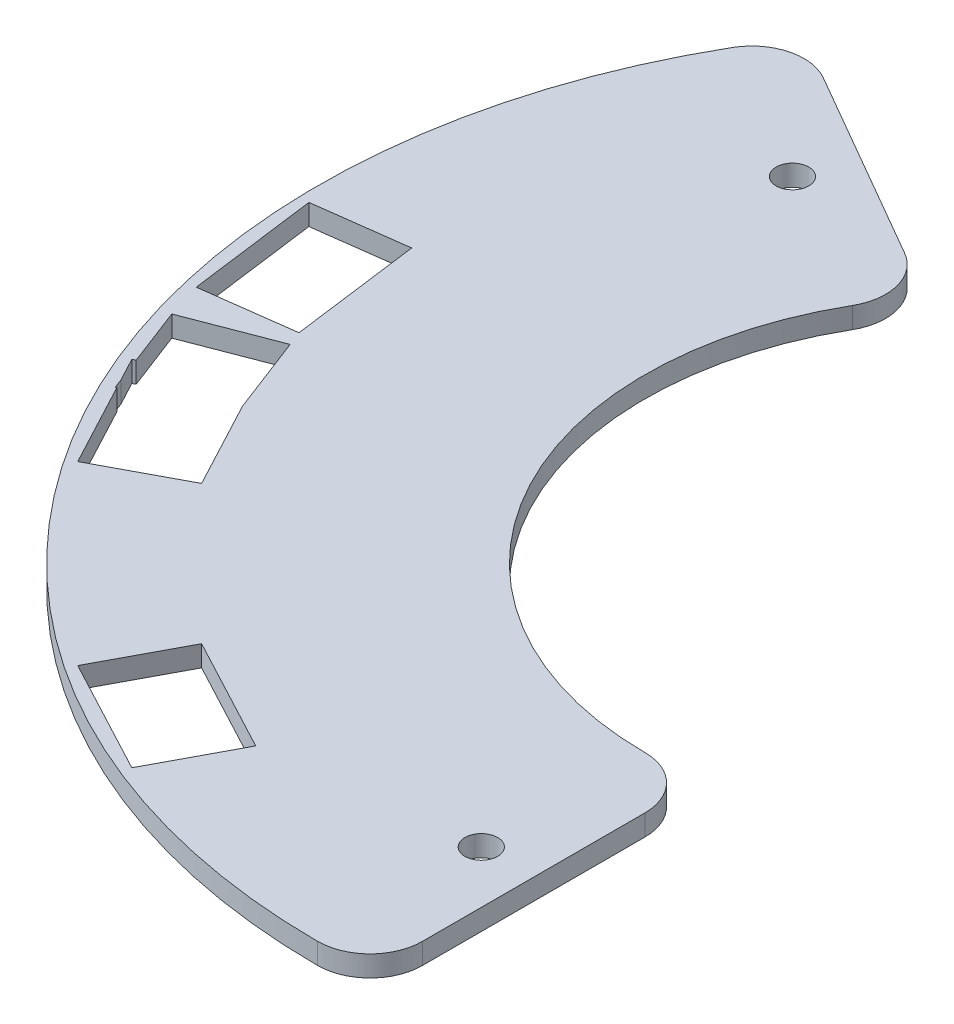
ISO-10303-21;
HEADER;
FILE_DESCRIPTION(('STEP AP214'),'2;1');
FILE_NAME('part.step','',(''),(''),'','','');
FILE_SCHEMA(('AUTOMOTIVE_DESIGN { 1 0 10303 214 1 1 1 1 }'));
ENDSEC;
DATA;
#1=APPLICATION_CONTEXT('core data for automotive mechanical design processes');
#2=APPLICATION_PROTOCOL_DEFINITION('international standard','automotive_design',2000,#1);
#3=PRODUCT_CONTEXT('',#1,'mechanical');
#4=PRODUCT('Part','Part','',(#3));
#5=PRODUCT_RELATED_PRODUCT_CATEGORY('part','',(#4));
#6=PRODUCT_DEFINITION_FORMATION('','',#4);
#7=PRODUCT_DEFINITION_CONTEXT('part definition',#1,'design');
#8=PRODUCT_DEFINITION('design','',#6,#7);
#9=PRODUCT_DEFINITION_SHAPE('','',#8);
#10=(LENGTH_UNIT() NAMED_UNIT(*) SI_UNIT(.MILLI.,.METRE.));
#11=(NAMED_UNIT(*) PLANE_ANGLE_UNIT() SI_UNIT($,.RADIAN.));
#12=(NAMED_UNIT(*) SI_UNIT($,.STERADIAN.) SOLID_ANGLE_UNIT());
#13=UNCERTAINTY_MEASURE_WITH_UNIT(LENGTH_MEASURE(1.E-05),#10,'distance_accuracy_value','');
#14=(GEOMETRIC_REPRESENTATION_CONTEXT(3) GLOBAL_UNCERTAINTY_ASSIGNED_CONTEXT((#13)) GLOBAL_UNIT_ASSIGNED_CONTEXT((#10,
#11,#12)) REPRESENTATION_CONTEXT('',''));
#15=CARTESIAN_POINT('',(0.,0.,0.));
#16=DIRECTION('',(0.,0.,1.));
#17=DIRECTION('',(1.,0.,0.));
#18=AXIS2_PLACEMENT_3D('',#15,#16,#17);
#19=CARTESIAN_POINT('',(0.,0.8,0.));
#20=DIRECTION('',(0.,1.,0.));
#21=DIRECTION('',(0.,0.,1.));
#22=AXIS2_PLACEMENT_3D('',#19,#20,#21);
#23=PLANE('',#22);
#24=DIRECTION('',(-0.991444861373811,0.,0.130526192220048));
#25=VECTOR('',#24,1.);
#26=CARTESIAN_POINT('',(-42.2933151388003,0.8,0.524875766372985));
#27=LINE('',#26,#25);
#28=CARTESIAN_POINT('',(-42.2933151388003,0.8,0.524875766372985));
#29=VERTEX_POINT('',#28);
#30=CARTESIAN_POINT('',(-49.233429168417,0.8,1.43855911191332));
#31=VERTEX_POINT('',#30);
#32=EDGE_CURVE('E288',#29,#31,#27,.T.);
#33=ORIENTED_EDGE('',*,*,#32,.F.);
#34=DIRECTION('',(0.130526192220048,0.,0.991444861373811));
#35=VECTOR('',#34,1.);
#36=CARTESIAN_POINT('',(-42.2933151388003,0.8,0.524875766372985));
#37=LINE('',#36,#35);
#38=CARTESIAN_POINT('',(-40.9880532165998,0.8,10.4393243801111));
#39=VERTEX_POINT('',#38);
#40=EDGE_CURVE('E292',#29,#39,#37,.T.);
#41=ORIENTED_EDGE('',*,*,#40,.T.);
#42=DIRECTION('',(-0.991444861373811,0.,0.130526192220048));
#43=VECTOR('',#42,1.);
#44=CARTESIAN_POINT('',(-40.9880532165998,0.8,10.4393243801111));
#45=LINE('',#44,#43);
#46=CARTESIAN_POINT('',(-47.9281672462165,0.8,11.3530077256514));
#47=VERTEX_POINT('',#46);
#48=EDGE_CURVE('E270',#39,#47,#45,.T.);
#49=ORIENTED_EDGE('',*,*,#48,.T.);
#50=DIRECTION('',(0.130526192220048,0.,0.991444861373811));
#51=VECTOR('',#50,1.);
#52=CARTESIAN_POINT('',(-49.233429168417,0.8,1.43855911191332));
#53=LINE('',#52,#51);
#54=EDGE_CURVE('E283',#31,#47,#53,.T.);
#55=ORIENTED_EDGE('',*,*,#54,.F.);
#56=EDGE_LOOP('',(#33,#41,#49,#55));
#57=FACE_BOUND('',#56,.T.);
#58=DIRECTION('',(-0.46947156278589,0.,0.882947592858927));
#59=VECTOR('',#58,1.);
#60=CARTESIAN_POINT('',(-24.1325436013021,0.8,34.7364410861455));
#61=LINE('',#60,#59);
#62=CARTESIAN_POINT('',(-24.1325436013021,0.8,34.7364410861455));
#63=VERTEX_POINT('',#62);
#64=CARTESIAN_POINT('',(-27.4188445408033,0.8,40.9170742361579));
#65=VERTEX_POINT('',#64);
#66=EDGE_CURVE('E360',#63,#65,#61,.T.);
#67=ORIENTED_EDGE('',*,*,#66,.F.);
#68=DIRECTION('',(0.882947592858928,0.,0.46947156278589));
#69=VECTOR('',#68,1.);
#70=CARTESIAN_POINT('',(-24.1325436013021,0.8,34.7364410861455));
#71=LINE('',#70,#69);
#72=CARTESIAN_POINT('',(-15.3030676727128,0.8,39.4311567140044));
#73=VERTEX_POINT('',#72);
#74=EDGE_CURVE('E348',#63,#73,#71,.T.);
#75=ORIENTED_EDGE('',*,*,#74,.T.);
#76=DIRECTION('',(-0.46947156278589,0.,0.882947592858927));
#77=VECTOR('',#76,1.);
#78=CARTESIAN_POINT('',(-15.3030676727128,0.8,39.4311567140044));
#79=LINE('',#78,#77);
#80=CARTESIAN_POINT('',(-18.589368612214,0.8,45.6117898640168));
#81=VERTEX_POINT('',#80);
#82=EDGE_CURVE('E352',#73,#81,#79,.T.);
#83=ORIENTED_EDGE('',*,*,#82,.T.);
#84=DIRECTION('',(0.882947592858927,0.,0.469471562785891));
#85=VECTOR('',#84,1.);
#86=CARTESIAN_POINT('',(-27.4188445408033,0.8,40.9170742361579));
#87=LINE('',#86,#85);
#88=EDGE_CURVE('E356',#65,#81,#87,.T.);
#89=ORIENTED_EDGE('',*,*,#88,.F.);
#90=EDGE_LOOP('',(#67,#75,#83,#89));
#91=FACE_BOUND('',#90,.T.);
#92=DIRECTION('',(-0.933580426497203,0.,0.358367949545297));
#93=VECTOR('',#92,1.);
#94=CARTESIAN_POINT('',(-40.5542577236774,0.8,11.550527281538));
#95=LINE('',#94,#93);
#96=CARTESIAN_POINT('',(-40.5542577236774,0.8,11.550527281538));
#97=VERTEX_POINT('',#96);
#98=CARTESIAN_POINT('',(-47.0893207091578,0.8,14.0591029283551));
#99=VERTEX_POINT('',#98);
#100=EDGE_CURVE('E388',#97,#99,#95,.T.);
#101=ORIENTED_EDGE('',*,*,#100,.F.);
#102=DIRECTION('',(0.358367949545297,0.,0.933580426497203));
#103=VECTOR('',#102,1.);
#104=CARTESIAN_POINT('',(-40.5542577236774,0.8,11.550527281538));
#105=LINE('',#104,#103);
#106=CARTESIAN_POINT('',(-38.2897915564523,0.8,17.4496633311451));
#107=VERTEX_POINT('',#106);
#108=EDGE_CURVE('E443',#97,#107,#105,.T.);
#109=ORIENTED_EDGE('',*,*,#108,.T.);
#110=DIRECTION('',(0.469471562785888,0.,0.882947592858928));
#111=VECTOR('',#110,1.);
#112=CARTESIAN_POINT('',(-39.4311567140044,0.8,15.3030676727127));
#113=LINE('',#112,#111);
#114=CARTESIAN_POINT('',(-34.7364410861455,0.8,24.132543601302));
#115=VERTEX_POINT('',#114);
#116=EDGE_CURVE('E403',#107,#115,#113,.T.);
#117=ORIENTED_EDGE('',*,*,#116,.T.);
#118=DIRECTION('',(-0.882947592858928,0.,0.469471562785888));
#119=VECTOR('',#118,1.);
#120=CARTESIAN_POINT('',(-34.7364410861455,0.8,24.132543601302));
#121=LINE('',#120,#119);
#122=CARTESIAN_POINT('',(-40.917074236158,0.8,27.4188445408032));
#123=VERTEX_POINT('',#122);
#124=EDGE_CURVE('E407',#115,#123,#121,.T.);
#125=ORIENTED_EDGE('',*,*,#124,.T.);
#126=DIRECTION('',(0.469471562785888,0.,0.882947592858928));
#127=VECTOR('',#126,1.);
#128=CARTESIAN_POINT('',(-45.6117898640169,0.8,18.5893686122139));
#129=LINE('',#128,#127);
#130=CARTESIAN_POINT('',(-44.3152416289966,0.8,21.0278211914148));
#131=VERTEX_POINT('',#130);
#132=EDGE_CURVE('E415',#131,#123,#129,.T.);
#133=ORIENTED_EDGE('',*,*,#132,.F.);
#134=DIRECTION('',(-0.933580426497203,0.,0.358367949545298));
#135=VECTOR('',#134,1.);
#136=CARTESIAN_POINT('',(-37.8664981020876,0.8,18.552380480267));
#137=LINE('',#136,#135);
#138=CARTESIAN_POINT('',(-44.401561087568,0.8,21.0609561270841));
#139=VERTEX_POINT('',#138);
#140=EDGE_CURVE('E447',#131,#139,#137,.T.);
#141=ORIENTED_EDGE('',*,*,#140,.T.);
#142=DIRECTION('',(0.358367949545297,0.,0.933580426497203));
#143=VECTOR('',#142,1.);
#144=CARTESIAN_POINT('',(-47.0893207091578,0.8,14.0591029283551));
#145=LINE('',#144,#143);
#146=CARTESIAN_POINT('',(-44.6714234825277,0.8,20.3579405530028));
#147=VERTEX_POINT('',#146);
#148=EDGE_CURVE('E454',#147,#139,#145,.T.);
#149=ORIENTED_EDGE('',*,*,#148,.F.);
#150=CARTESIAN_POINT('',(-45.6117898640169,0.8,18.5893686122139));
#151=VERTEX_POINT('',#150);
#152=EDGE_CURVE('E411',#151,#147,#129,.T.);
#153=ORIENTED_EDGE('',*,*,#152,.F.);
#154=DIRECTION('',(-0.882947592858928,0.,0.469471562785888));
#155=VECTOR('',#154,1.);
#156=CARTESIAN_POINT('',(-39.4311567140044,0.8,15.3030676727127));
#157=LINE('',#156,#155);
#158=CARTESIAN_POINT('',(-45.394636534842,0.8,18.4739061389749));
#159=VERTEX_POINT('',#158);
#160=EDGE_CURVE('E333',#159,#151,#157,.T.);
#161=ORIENTED_EDGE('',*,*,#160,.F.);
#162=EDGE_CURVE('E451',#99,#159,#145,.T.);
#163=ORIENTED_EDGE('',*,*,#162,.F.);
#164=EDGE_LOOP('',(#101,#109,#117,#125,#133,#141,#149,#153,#161,#163));
#165=FACE_BOUND('',#164,.T.);
#166=CARTESIAN_POINT('',(-32.4759526419164,0.8,-18.7500000000001));
#167=DIRECTION('',(0.,1.,0.));
#168=DIRECTION('',(0.,0.,1.));
#169=AXIS2_PLACEMENT_3D('',#166,#167,#168);
#170=CIRCLE('',#169,1.25);
#171=CARTESIAN_POINT('',(-32.4759526419164,0.8,-17.5000000000001));
#172=VERTEX_POINT('',#171);
#173=EDGE_CURVE('E466',#172,#172,#170,.T.);
#174=ORIENTED_EDGE('',*,*,#173,.F.);
#175=EDGE_LOOP('',(#174));
#176=FACE_BOUND('',#175,.T.);
#177=CARTESIAN_POINT('',(0.,0.8,0.));
#178=DIRECTION('',(0.,1.,0.));
#179=DIRECTION('',(0.,0.,1.));
#180=AXIS2_PLACEMENT_3D('',#177,#178,#179);
#181=CIRCLE('',#180,50.);
#182=CARTESIAN_POINT('',(-43.3012701892218,0.8,-25.0000000000002));
#183=VERTEX_POINT('',#182);
#184=CARTESIAN_POINT('',(0.,0.8,50.));
#185=VERTEX_POINT('',#184);
#186=EDGE_CURVE('E474',#183,#185,#181,.T.);
#187=ORIENTED_EDGE('',*,*,#186,.T.);
#188=CARTESIAN_POINT('',(0.,0.8,46.));
#189=DIRECTION('',(0.,1.,0.));
#190=DIRECTION('',(0.,0.,1.));
#191=AXIS2_PLACEMENT_3D('',#188,#189,#190);
#192=CIRCLE('',#191,4.);
#193=CARTESIAN_POINT('',(4.,0.8,46.));
#194=VERTEX_POINT('',#193);
#195=EDGE_CURVE('E536',#185,#194,#192,.T.);
#196=ORIENTED_EDGE('',*,*,#195,.T.);
#197=DIRECTION('',(0.,0.,-1.));
#198=VECTOR('',#197,1.);
#199=CARTESIAN_POINT('',(4.,0.8,24.6779253585061));
#200=LINE('',#199,#198);
#201=CARTESIAN_POINT('',(4.,0.8,29.));
#202=VERTEX_POINT('',#201);
#203=EDGE_CURVE('E478',#194,#202,#200,.T.);
#204=ORIENTED_EDGE('',*,*,#203,.T.);
#205=CARTESIAN_POINT('',(0.,0.8,29.));
#206=DIRECTION('',(0.,1.,0.));
#207=DIRECTION('',(0.,0.,1.));
#208=AXIS2_PLACEMENT_3D('',#205,#206,#207);
#209=CIRCLE('',#208,4.);
#210=CARTESIAN_POINT('',(0.,0.8,25.));
#211=VERTEX_POINT('',#210);
#212=EDGE_CURVE('E528',#202,#211,#209,.T.);
#213=ORIENTED_EDGE('',*,*,#212,.T.);
#214=CARTESIAN_POINT('',(0.,0.8,0.));
#215=DIRECTION('',(0.,-1.,0.));
#216=DIRECTION('',(0.,0.,1.));
#217=AXIS2_PLACEMENT_3D('',#214,#215,#216);
#218=CIRCLE('',#217,25.);
#219=CARTESIAN_POINT('',(-21.6506350946109,0.8,-12.5000000000001));
#220=VERTEX_POINT('',#219);
#221=EDGE_CURVE('E483',#211,#220,#218,.T.);
#222=ORIENTED_EDGE('',*,*,#221,.T.);
#223=CARTESIAN_POINT('',(-25.1147367097487,0.8,-14.5000000000001));
#224=DIRECTION('',(0.,1.,0.));
#225=DIRECTION('',(0.,0.,1.));
#226=AXIS2_PLACEMENT_3D('',#223,#224,#225);
#227=CIRCLE('',#226,4.);
#228=CARTESIAN_POINT('',(-23.1147367097486,0.8,-17.9641016151379));
#229=VERTEX_POINT('',#228);
#230=EDGE_CURVE('E113',#220,#229,#227,.T.);
#231=ORIENTED_EDGE('',*,*,#230,.T.);
#232=DIRECTION('',(-0.866025403784436,0.,-0.500000000000004));
#233=VECTOR('',#232,1.);
#234=CARTESIAN_POINT('',(-41.1624837098143,0.8,-28.3839732038922));
#235=LINE('',#234,#233);
#236=CARTESIAN_POINT('',(-37.8371685740841,0.8,-26.4641016151379));
#237=VERTEX_POINT('',#236);
#238=EDGE_CURVE('E486',#229,#237,#235,.T.);
#239=ORIENTED_EDGE('',*,*,#238,.T.);
#240=CARTESIAN_POINT('',(-39.8371685740841,0.8,-23.0000000000002));
#241=DIRECTION('',(0.,1.,0.));
#242=DIRECTION('',(0.,0.,1.));
#243=AXIS2_PLACEMENT_3D('',#240,#241,#242);
#244=CIRCLE('',#243,4.);
#245=EDGE_CURVE('E533',#237,#183,#244,.T.);
#246=ORIENTED_EDGE('',*,*,#245,.T.);
#247=EDGE_LOOP('',(#187,#196,#204,#213,#222,#231,#239,#246));
#248=FACE_BOUND('',#247,.T.);
#249=CARTESIAN_POINT('',(0.,0.8,37.5));
#250=DIRECTION('',(0.,1.,0.));
#251=DIRECTION('',(0.,0.,1.));
#252=AXIS2_PLACEMENT_3D('',#249,#250,#251);
#253=CIRCLE('',#252,1.25);
#254=CARTESIAN_POINT('',(0.,0.8,38.75));
#255=VERTEX_POINT('',#254);
#256=EDGE_CURVE('E458',#255,#255,#253,.T.);
#257=ORIENTED_EDGE('',*,*,#256,.F.);
#258=EDGE_LOOP('',(#257));
#259=FACE_BOUND('',#258,.T.);
#260=ADVANCED_FACE('F90',(#57,#91,#165,#176,#248,#259),#23,.T.);
#261=CARTESIAN_POINT('',(0.,-0.8,0.));
#262=DIRECTION('',(0.,1.,0.));
#263=DIRECTION('',(0.,0.,1.));
#264=AXIS2_PLACEMENT_3D('',#261,#262,#263);
#265=PLANE('',#264);
#266=DIRECTION('',(0.130526192220048,0.,0.991444861373811));
#267=VECTOR('',#266,1.);
#268=CARTESIAN_POINT('',(-42.2933151388003,-0.8,0.524875766372985));
#269=LINE('',#268,#267);
#270=CARTESIAN_POINT('',(-42.2933151388003,-0.8,0.524875766372985));
#271=VERTEX_POINT('',#270);
#272=CARTESIAN_POINT('',(-40.9880532165998,-0.8,10.4393243801111));
#273=VERTEX_POINT('',#272);
#274=EDGE_CURVE('E308',#271,#273,#269,.T.);
#275=ORIENTED_EDGE('',*,*,#274,.F.);
#276=DIRECTION('',(-0.991444861373811,0.,0.130526192220048));
#277=VECTOR('',#276,1.);
#278=CARTESIAN_POINT('',(-42.2933151388003,-0.8,0.524875766372985));
#279=LINE('',#278,#277);
#280=CARTESIAN_POINT('',(-49.233429168417,-0.8,1.43855911191332));
#281=VERTEX_POINT('',#280);
#282=EDGE_CURVE('E296',#271,#281,#279,.T.);
#283=ORIENTED_EDGE('',*,*,#282,.T.);
#284=DIRECTION('',(0.130526192220048,0.,0.991444861373811));
#285=VECTOR('',#284,1.);
#286=CARTESIAN_POINT('',(-49.233429168417,-0.8,1.43855911191332));
#287=LINE('',#286,#285);
#288=CARTESIAN_POINT('',(-47.9281672462165,-0.8,11.3530077256514));
#289=VERTEX_POINT('',#288);
#290=EDGE_CURVE('E303',#281,#289,#287,.T.);
#291=ORIENTED_EDGE('',*,*,#290,.T.);
#292=DIRECTION('',(-0.991444861373811,0.,0.130526192220048));
#293=VECTOR('',#292,1.);
#294=CARTESIAN_POINT('',(-40.9880532165998,-0.8,10.4393243801111));
#295=LINE('',#294,#293);
#296=EDGE_CURVE('E273',#273,#289,#295,.T.);
#297=ORIENTED_EDGE('',*,*,#296,.F.);
#298=EDGE_LOOP('',(#275,#283,#291,#297));
#299=FACE_BOUND('',#298,.T.);
#300=DIRECTION('',(0.882947592858928,0.,0.46947156278589));
#301=VECTOR('',#300,1.);
#302=CARTESIAN_POINT('',(-24.1325436013021,-0.8,34.7364410861455));
#303=LINE('',#302,#301);
#304=CARTESIAN_POINT('',(-24.1325436013021,-0.8,34.7364410861455));
#305=VERTEX_POINT('',#304);
#306=CARTESIAN_POINT('',(-15.3030676727128,-0.8,39.4311567140044));
#307=VERTEX_POINT('',#306);
#308=EDGE_CURVE('E323',#305,#307,#303,.T.);
#309=ORIENTED_EDGE('',*,*,#308,.F.);
#310=DIRECTION('',(-0.46947156278589,0.,0.882947592858927));
#311=VECTOR('',#310,1.);
#312=CARTESIAN_POINT('',(-24.1325436013021,-0.8,34.7364410861455));
#313=LINE('',#312,#311);
#314=CARTESIAN_POINT('',(-27.4188445408033,-0.8,40.9170742361579));
#315=VERTEX_POINT('',#314);
#316=EDGE_CURVE('E344',#305,#315,#313,.T.);
#317=ORIENTED_EDGE('',*,*,#316,.T.);
#318=DIRECTION('',(0.882947592858927,0.,0.469471562785891));
#319=VECTOR('',#318,1.);
#320=CARTESIAN_POINT('',(-27.4188445408033,-0.8,40.9170742361579));
#321=LINE('',#320,#319);
#322=CARTESIAN_POINT('',(-18.589368612214,-0.8,45.6117898640168));
#323=VERTEX_POINT('',#322);
#324=EDGE_CURVE('E340',#315,#323,#321,.T.);
#325=ORIENTED_EDGE('',*,*,#324,.T.);
#326=DIRECTION('',(-0.46947156278589,0.,0.882947592858927));
#327=VECTOR('',#326,1.);
#328=CARTESIAN_POINT('',(-15.3030676727128,-0.8,39.4311567140044));
#329=LINE('',#328,#327);
#330=EDGE_CURVE('E336',#307,#323,#329,.T.);
#331=ORIENTED_EDGE('',*,*,#330,.F.);
#332=EDGE_LOOP('',(#309,#317,#325,#331));
#333=FACE_BOUND('',#332,.T.);
#334=DIRECTION('',(0.358367949545297,0.,0.933580426497203));
#335=VECTOR('',#334,1.);
#336=CARTESIAN_POINT('',(-40.5542577236774,-0.8,11.550527281538));
#337=LINE('',#336,#335);
#338=CARTESIAN_POINT('',(-40.5542577236774,-0.8,11.550527281538));
#339=VERTEX_POINT('',#338);
#340=CARTESIAN_POINT('',(-38.2897915564523,-0.8,17.4496633311451));
#341=VERTEX_POINT('',#340);
#342=EDGE_CURVE('E421',#339,#341,#337,.T.);
#343=ORIENTED_EDGE('',*,*,#342,.F.);
#344=DIRECTION('',(-0.933580426497203,0.,0.358367949545297));
#345=VECTOR('',#344,1.);
#346=CARTESIAN_POINT('',(-40.5542577236774,-0.8,11.550527281538));
#347=LINE('',#346,#345);
#348=CARTESIAN_POINT('',(-47.0893207091578,-0.8,14.0591029283551));
#349=VERTEX_POINT('',#348);
#350=EDGE_CURVE('E439',#339,#349,#347,.T.);
#351=ORIENTED_EDGE('',*,*,#350,.T.);
#352=DIRECTION('',(0.358367949545297,0.,0.933580426497203));
#353=VECTOR('',#352,1.);
#354=CARTESIAN_POINT('',(-47.0893207091578,-0.8,14.0591029283551));
#355=LINE('',#354,#353);
#356=CARTESIAN_POINT('',(-45.394636534842,-0.8,18.4739061389749));
#357=VERTEX_POINT('',#356);
#358=EDGE_CURVE('E434',#349,#357,#355,.T.);
#359=ORIENTED_EDGE('',*,*,#358,.T.);
#360=DIRECTION('',(-0.882947592858928,0.,0.469471562785888));
#361=VECTOR('',#360,1.);
#362=CARTESIAN_POINT('',(-39.4311567140044,-0.8,15.3030676727127));
#363=LINE('',#362,#361);
#364=CARTESIAN_POINT('',(-45.6117898640169,-0.8,18.5893686122139));
#365=VERTEX_POINT('',#364);
#366=EDGE_CURVE('E399',#357,#365,#363,.T.);
#367=ORIENTED_EDGE('',*,*,#366,.T.);
#368=DIRECTION('',(0.469471562785888,0.,0.882947592858928));
#369=VECTOR('',#368,1.);
#370=CARTESIAN_POINT('',(-45.6117898640169,-0.8,18.5893686122139));
#371=LINE('',#370,#369);
#372=CARTESIAN_POINT('',(-44.6714234825277,-0.8,20.3579405530028));
#373=VERTEX_POINT('',#372);
#374=EDGE_CURVE('E394',#365,#373,#371,.T.);
#375=ORIENTED_EDGE('',*,*,#374,.T.);
#376=CARTESIAN_POINT('',(-44.401561087568,-0.8,21.0609561270841));
#377=VERTEX_POINT('',#376);
#378=EDGE_CURVE('E438',#373,#377,#355,.T.);
#379=ORIENTED_EDGE('',*,*,#378,.T.);
#380=DIRECTION('',(-0.933580426497203,0.,0.358367949545298));
#381=VECTOR('',#380,1.);
#382=CARTESIAN_POINT('',(-37.8664981020876,-0.8,18.552380480267));
#383=LINE('',#382,#381);
#384=CARTESIAN_POINT('',(-44.3152416289966,-0.8,21.0278211914148));
#385=VERTEX_POINT('',#384);
#386=EDGE_CURVE('E431',#385,#377,#383,.T.);
#387=ORIENTED_EDGE('',*,*,#386,.F.);
#388=CARTESIAN_POINT('',(-40.917074236158,-0.8,27.4188445408032));
#389=VERTEX_POINT('',#388);
#390=EDGE_CURVE('E398',#385,#389,#371,.T.);
#391=ORIENTED_EDGE('',*,*,#390,.T.);
#392=DIRECTION('',(-0.882947592858928,0.,0.469471562785888));
#393=VECTOR('',#392,1.);
#394=CARTESIAN_POINT('',(-34.7364410861455,-0.8,24.132543601302));
#395=LINE('',#394,#393);
#396=CARTESIAN_POINT('',(-34.7364410861455,-0.8,24.132543601302));
#397=VERTEX_POINT('',#396);
#398=EDGE_CURVE('E391',#397,#389,#395,.T.);
#399=ORIENTED_EDGE('',*,*,#398,.F.);
#400=DIRECTION('',(0.469471562785888,0.,0.882947592858928));
#401=VECTOR('',#400,1.);
#402=CARTESIAN_POINT('',(-39.4311567140044,-0.8,15.3030676727127));
#403=LINE('',#402,#401);
#404=EDGE_CURVE('E380',#341,#397,#403,.T.);
#405=ORIENTED_EDGE('',*,*,#404,.F.);
#406=EDGE_LOOP('',(#343,#351,#359,#367,#375,#379,#387,#391,#399,#405));
#407=FACE_BOUND('',#406,.T.);
#408=DIRECTION('',(0.,0.,-1.));
#409=VECTOR('',#408,1.);
#410=CARTESIAN_POINT('',(4.,-0.8,24.6779253585061));
#411=LINE('',#410,#409);
#412=CARTESIAN_POINT('',(4.,-0.8,46.));
#413=VERTEX_POINT('',#412);
#414=CARTESIAN_POINT('',(4.,-0.8,29.));
#415=VERTEX_POINT('',#414);
#416=EDGE_CURVE('E493',#413,#415,#411,.T.);
#417=ORIENTED_EDGE('',*,*,#416,.F.);
#418=CARTESIAN_POINT('',(0.,-0.8,46.));
#419=DIRECTION('',(0.,1.,0.));
#420=DIRECTION('',(0.,0.,1.));
#421=AXIS2_PLACEMENT_3D('',#418,#419,#420);
#422=CIRCLE('',#421,4.);
#423=CARTESIAN_POINT('',(0.,-0.8,50.));
#424=VERTEX_POINT('',#423);
#425=EDGE_CURVE('E518',#413,#424,#422,.F.);
#426=ORIENTED_EDGE('',*,*,#425,.T.);
#427=CARTESIAN_POINT('',(0.,-0.8,0.));
#428=DIRECTION('',(0.,1.,0.));
#429=DIRECTION('',(0.,0.,1.));
#430=AXIS2_PLACEMENT_3D('',#427,#428,#429);
#431=CIRCLE('',#430,50.);
#432=CARTESIAN_POINT('',(-43.3012701892218,-0.8,-25.0000000000002));
#433=VERTEX_POINT('',#432);
#434=EDGE_CURVE('E470',#433,#424,#431,.T.);
#435=ORIENTED_EDGE('',*,*,#434,.F.);
#436=CARTESIAN_POINT('',(-39.8371685740841,-0.8,-23.0000000000002));
#437=DIRECTION('',(0.,1.,0.));
#438=DIRECTION('',(0.,0.,1.));
#439=AXIS2_PLACEMENT_3D('',#436,#437,#438);
#440=CIRCLE('',#439,4.);
#441=CARTESIAN_POINT('',(-37.8371685740841,-0.8,-26.4641016151379));
#442=VERTEX_POINT('',#441);
#443=EDGE_CURVE('E515',#433,#442,#440,.F.);
#444=ORIENTED_EDGE('',*,*,#443,.T.);
#445=DIRECTION('',(-0.866025403784436,0.,-0.500000000000004));
#446=VECTOR('',#445,1.);
#447=CARTESIAN_POINT('',(-41.1624837098143,-0.8,-28.3839732038922));
#448=LINE('',#447,#446);
#449=CARTESIAN_POINT('',(-23.1147367097486,-0.8,-17.9641016151379));
#450=VERTEX_POINT('',#449);
#451=EDGE_CURVE('E479',#450,#442,#448,.T.);
#452=ORIENTED_EDGE('',*,*,#451,.F.);
#453=CARTESIAN_POINT('',(-25.1147367097487,-0.8,-14.5000000000001));
#454=DIRECTION('',(0.,1.,0.));
#455=DIRECTION('',(0.,0.,1.));
#456=AXIS2_PLACEMENT_3D('',#453,#454,#455);
#457=CIRCLE('',#456,4.);
#458=CARTESIAN_POINT('',(-21.6506350946109,-0.8,-12.5000000000001));
#459=VERTEX_POINT('',#458);
#460=EDGE_CURVE('E512',#450,#459,#457,.F.);
#461=ORIENTED_EDGE('',*,*,#460,.T.);
#462=CARTESIAN_POINT('',(0.,-0.8,0.));
#463=DIRECTION('',(0.,-1.,0.));
#464=DIRECTION('',(0.,0.,1.));
#465=AXIS2_PLACEMENT_3D('',#462,#463,#464);
#466=CIRCLE('',#465,25.);
#467=CARTESIAN_POINT('',(0.,-0.8,25.));
#468=VERTEX_POINT('',#467);
#469=EDGE_CURVE('E497',#468,#459,#466,.T.);
#470=ORIENTED_EDGE('',*,*,#469,.F.);
#471=CARTESIAN_POINT('',(0.,-0.8,29.));
#472=DIRECTION('',(0.,1.,0.));
#473=DIRECTION('',(0.,0.,1.));
#474=AXIS2_PLACEMENT_3D('',#471,#472,#473);
#475=CIRCLE('',#474,4.);
#476=EDGE_CURVE('E509',#468,#415,#475,.F.);
#477=ORIENTED_EDGE('',*,*,#476,.T.);
#478=EDGE_LOOP('',(#417,#426,#435,#444,#452,#461,#470,#477));
#479=FACE_BOUND('',#478,.T.);
#480=CARTESIAN_POINT('',(-32.4759526419164,-0.8,-18.7500000000001));
#481=DIRECTION('',(0.,1.,0.));
#482=DIRECTION('',(0.,0.,1.));
#483=AXIS2_PLACEMENT_3D('',#480,#481,#482);
#484=CIRCLE('',#483,1.25);
#485=CARTESIAN_POINT('',(-32.4759526419164,-0.8,-17.5000000000001));
#486=VERTEX_POINT('',#485);
#487=EDGE_CURVE('E462',#486,#486,#484,.T.);
#488=ORIENTED_EDGE('',*,*,#487,.T.);
#489=EDGE_LOOP('',(#488));
#490=FACE_BOUND('',#489,.T.);
#491=CARTESIAN_POINT('',(0.,-0.8,37.5));
#492=DIRECTION('',(0.,1.,0.));
#493=DIRECTION('',(0.,0.,1.));
#494=AXIS2_PLACEMENT_3D('',#491,#492,#493);
#495=CIRCLE('',#494,1.25);
#496=CARTESIAN_POINT('',(0.,-0.8,38.75));
#497=VERTEX_POINT('',#496);
#498=EDGE_CURVE('E314',#497,#497,#495,.T.);
#499=ORIENTED_EDGE('',*,*,#498,.T.);
#500=EDGE_LOOP('',(#499));
#501=FACE_BOUND('',#500,.T.);
#502=ADVANCED_FACE('F556',(#299,#333,#407,#479,#490,#501),#265,.F.);
#503=CARTESIAN_POINT('',(0.,0.8,0.));
#504=DIRECTION('',(0.,-1.,0.));
#505=DIRECTION('',(0.,0.,-1.));
#506=AXIS2_PLACEMENT_3D('',#503,#504,#505);
#507=CYLINDRICAL_SURFACE('',#506,50.);
#508=ORIENTED_EDGE('',*,*,#434,.T.);
#509=DIRECTION('',(0.,-1.,0.));
#510=VECTOR('',#509,1.);
#511=CARTESIAN_POINT('',(0.,0.8,50.));
#512=LINE('',#511,#510);
#513=EDGE_CURVE('E525',#424,#185,#512,.F.);
#514=ORIENTED_EDGE('',*,*,#513,.T.);
#515=ORIENTED_EDGE('',*,*,#186,.F.);
#516=DIRECTION('',(0.,-1.,0.));
#517=VECTOR('',#516,1.);
#518=CARTESIAN_POINT('',(-43.3012701892218,0.8,-25.0000000000002));
#519=LINE('',#518,#517);
#520=EDGE_CURVE('E521',#183,#433,#519,.T.);
#521=ORIENTED_EDGE('',*,*,#520,.T.);
#522=EDGE_LOOP('',(#508,#514,#515,#521));
#523=FACE_BOUND('',#522,.T.);
#524=ADVANCED_FACE('F571',(#523),#507,.T.);
#525=CARTESIAN_POINT('',(4.,0.8,24.6779253585061));
#526=DIRECTION('',(-1.,0.,0.));
#527=DIRECTION('',(0.,0.,1.));
#528=AXIS2_PLACEMENT_3D('',#525,#526,#527);
#529=PLANE('',#528);
#530=ORIENTED_EDGE('',*,*,#203,.F.);
#531=DIRECTION('',(0.,-1.,0.));
#532=VECTOR('',#531,1.);
#533=CARTESIAN_POINT('',(4.,0.8,46.));
#534=LINE('',#533,#532);
#535=EDGE_CURVE('E505',#194,#413,#534,.T.);
#536=ORIENTED_EDGE('',*,*,#535,.T.);
#537=ORIENTED_EDGE('',*,*,#416,.T.);
#538=DIRECTION('',(0.,-1.,0.));
#539=VECTOR('',#538,1.);
#540=CARTESIAN_POINT('',(4.,0.8,29.));
#541=LINE('',#540,#539);
#542=EDGE_CURVE('E489',#415,#202,#541,.F.);
#543=ORIENTED_EDGE('',*,*,#542,.T.);
#544=EDGE_LOOP('',(#530,#536,#537,#543));
#545=FACE_BOUND('',#544,.T.);
#546=ADVANCED_FACE('F579',(#545),#529,.F.);
#547=CARTESIAN_POINT('',(0.,0.8,0.));
#548=DIRECTION('',(0.,-1.,0.));
#549=DIRECTION('',(0.,0.,-1.));
#550=AXIS2_PLACEMENT_3D('',#547,#548,#549);
#551=CYLINDRICAL_SURFACE('',#550,25.);
#552=ORIENTED_EDGE('',*,*,#469,.T.);
#553=DIRECTION('',(0.,-1.,0.));
#554=VECTOR('',#553,1.);
#555=CARTESIAN_POINT('',(-21.6506350946109,0.8,-12.5000000000001));
#556=LINE('',#555,#554);
#557=EDGE_CURVE('E12',#459,#220,#556,.F.);
#558=ORIENTED_EDGE('',*,*,#557,.T.);
#559=ORIENTED_EDGE('',*,*,#221,.F.);
#560=DIRECTION('',(0.,-1.,0.));
#561=VECTOR('',#560,1.);
#562=CARTESIAN_POINT('',(0.,0.8,25.));
#563=LINE('',#562,#561);
#564=EDGE_CURVE('E99',#211,#468,#563,.T.);
#565=ORIENTED_EDGE('',*,*,#564,.T.);
#566=EDGE_LOOP('',(#552,#558,#559,#565));
#567=FACE_BOUND('',#566,.T.);
#568=ADVANCED_FACE('F550',(#567),#551,.F.);
#569=CARTESIAN_POINT('',(-41.1624837098143,0.8,-28.3839732038922));
#570=DIRECTION('',(-0.500000000000004,0.,0.866025403784436));
#571=DIRECTION('',(0.866025403784436,0.,0.500000000000004));
#572=AXIS2_PLACEMENT_3D('',#569,#570,#571);
#573=PLANE('',#572);
#574=ORIENTED_EDGE('',*,*,#451,.T.);
#575=DIRECTION('',(0.,-1.,0.));
#576=VECTOR('',#575,1.);
#577=CARTESIAN_POINT('',(-37.8371685740841,0.8,-26.4641016151379));
#578=LINE('',#577,#576);
#579=EDGE_CURVE('E106',#442,#237,#578,.F.);
#580=ORIENTED_EDGE('',*,*,#579,.T.);
#581=ORIENTED_EDGE('',*,*,#238,.F.);
#582=DIRECTION('',(0.,-1.,0.));
#583=VECTOR('',#582,1.);
#584=CARTESIAN_POINT('',(-23.1147367097486,0.8,-17.9641016151379));
#585=LINE('',#584,#583);
#586=EDGE_CURVE('E539',#229,#450,#585,.T.);
#587=ORIENTED_EDGE('',*,*,#586,.T.);
#588=EDGE_LOOP('',(#574,#580,#581,#587));
#589=FACE_BOUND('',#588,.T.);
#590=ADVANCED_FACE('F562',(#589),#573,.F.);
#591=CARTESIAN_POINT('',(-32.4759526419164,0.8,-18.7500000000001));
#592=DIRECTION('',(0.,-1.,0.));
#593=DIRECTION('',(0.,0.,-1.));
#594=AXIS2_PLACEMENT_3D('',#591,#592,#593);
#595=CYLINDRICAL_SURFACE('',#594,1.25);
#596=ORIENTED_EDGE('',*,*,#173,.T.);
#597=EDGE_LOOP('',(#596));
#598=FACE_BOUND('',#597,.T.);
#599=ORIENTED_EDGE('',*,*,#487,.F.);
#600=EDGE_LOOP('',(#599));
#601=FACE_BOUND('',#600,.T.);
#602=ADVANCED_FACE('F594',(#598,#601),#595,.F.);
#603=CARTESIAN_POINT('',(0.,0.8,37.5));
#604=DIRECTION('',(0.,-1.,0.));
#605=DIRECTION('',(0.,0.,-1.));
#606=AXIS2_PLACEMENT_3D('',#603,#604,#605);
#607=CYLINDRICAL_SURFACE('',#606,1.25);
#608=ORIENTED_EDGE('',*,*,#256,.T.);
#609=EDGE_LOOP('',(#608));
#610=FACE_BOUND('',#609,.T.);
#611=ORIENTED_EDGE('',*,*,#498,.F.);
#612=EDGE_LOOP('',(#611));
#613=FACE_BOUND('',#612,.T.);
#614=ADVANCED_FACE('F807',(#610,#613),#607,.F.);
#615=CARTESIAN_POINT('',(-47.0893207091578,-0.8,14.0591029283551));
#616=DIRECTION('',(-0.933580426497203,0.,0.358367949545297));
#617=DIRECTION('',(0.358367949545297,0.,0.933580426497203));
#618=AXIS2_PLACEMENT_3D('',#615,#616,#617);
#619=PLANE('',#618);
#620=DIRECTION('',(0.,-1.,0.));
#621=VECTOR('',#620,1.);
#622=CARTESIAN_POINT('',(-45.394636534842,-0.8,18.4739061389749));
#623=LINE('',#622,#621);
#624=EDGE_CURVE('E363',#159,#357,#623,.T.);
#625=ORIENTED_EDGE('',*,*,#624,.T.);
#626=ORIENTED_EDGE('',*,*,#358,.F.);
#627=DIRECTION('',(0.,1.,0.));
#628=VECTOR('',#627,1.);
#629=CARTESIAN_POINT('',(-47.0893207091578,-0.8,14.0591029283551));
#630=LINE('',#629,#628);
#631=EDGE_CURVE('E418',#349,#99,#630,.T.);
#632=ORIENTED_EDGE('',*,*,#631,.T.);
#633=ORIENTED_EDGE('',*,*,#162,.T.);
#634=EDGE_LOOP('',(#625,#626,#632,#633));
#635=FACE_BOUND('',#634,.T.);
#636=ADVANCED_FACE('F770',(#635),#619,.F.);
#637=CARTESIAN_POINT('',(-40.5542577236774,-0.8,11.550527281538));
#638=DIRECTION('',(-0.358367949545297,0.,-0.933580426497203));
#639=DIRECTION('',(-0.933580426497203,0.,0.358367949545297));
#640=AXIS2_PLACEMENT_3D('',#637,#638,#639);
#641=PLANE('',#640);
#642=ORIENTED_EDGE('',*,*,#631,.F.);
#643=ORIENTED_EDGE('',*,*,#350,.F.);
#644=DIRECTION('',(0.,1.,0.));
#645=VECTOR('',#644,1.);
#646=CARTESIAN_POINT('',(-40.5542577236774,-0.8,11.550527281538));
#647=LINE('',#646,#645);
#648=EDGE_CURVE('E375',#339,#97,#647,.T.);
#649=ORIENTED_EDGE('',*,*,#648,.T.);
#650=ORIENTED_EDGE('',*,*,#100,.T.);
#651=EDGE_LOOP('',(#642,#643,#649,#650));
#652=FACE_BOUND('',#651,.T.);
#653=ADVANCED_FACE('F788',(#652),#641,.F.);
#654=CARTESIAN_POINT('',(-40.5542577236774,-0.8,11.550527281538));
#655=DIRECTION('',(-0.933580426497203,0.,0.358367949545297));
#656=DIRECTION('',(0.358367949545297,0.,0.933580426497203));
#657=AXIS2_PLACEMENT_3D('',#654,#655,#656);
#658=PLANE('',#657);
#659=DIRECTION('',(0.,1.,0.));
#660=VECTOR('',#659,1.);
#661=CARTESIAN_POINT('',(-38.2897915564523,-0.8,17.4496633311451));
#662=LINE('',#661,#660);
#663=EDGE_CURVE('E368',#341,#107,#662,.T.);
#664=ORIENTED_EDGE('',*,*,#663,.T.);
#665=ORIENTED_EDGE('',*,*,#108,.F.);
#666=ORIENTED_EDGE('',*,*,#648,.F.);
#667=ORIENTED_EDGE('',*,*,#342,.T.);
#668=EDGE_LOOP('',(#664,#665,#666,#667));
#669=FACE_BOUND('',#668,.T.);
#670=ADVANCED_FACE('F778',(#669),#658,.T.);
#671=CARTESIAN_POINT('',(-37.8664981020876,-0.8,18.552380480267));
#672=DIRECTION('',(-0.358367949545298,0.,-0.933580426497203));
#673=DIRECTION('',(-0.933580426497203,0.,0.358367949545298));
#674=AXIS2_PLACEMENT_3D('',#671,#672,#673);
#675=PLANE('',#674);
#676=ORIENTED_EDGE('',*,*,#386,.T.);
#677=DIRECTION('',(0.,1.,0.));
#678=VECTOR('',#677,1.);
#679=CARTESIAN_POINT('',(-44.401561087568,-0.8,21.0609561270841));
#680=LINE('',#679,#678);
#681=EDGE_CURVE('E422',#377,#139,#680,.T.);
#682=ORIENTED_EDGE('',*,*,#681,.T.);
#683=ORIENTED_EDGE('',*,*,#140,.F.);
#684=DIRECTION('',(0.,1.,0.));
#685=VECTOR('',#684,1.);
#686=CARTESIAN_POINT('',(-44.3152416289966,-0.8,21.0278211914148));
#687=LINE('',#686,#685);
#688=EDGE_CURVE('E367',#385,#131,#687,.T.);
#689=ORIENTED_EDGE('',*,*,#688,.F.);
#690=EDGE_LOOP('',(#676,#682,#683,#689));
#691=FACE_BOUND('',#690,.T.);
#692=ADVANCED_FACE('F767',(#691),#675,.T.);
#693=DIRECTION('',(0.,1.,0.));
#694=VECTOR('',#693,1.);
#695=CARTESIAN_POINT('',(-44.6714234825277,-0.8,20.3579405530027));
#696=LINE('',#695,#694);
#697=EDGE_CURVE('E366',#373,#147,#696,.T.);
#698=ORIENTED_EDGE('',*,*,#697,.T.);
#699=ORIENTED_EDGE('',*,*,#148,.T.);
#700=ORIENTED_EDGE('',*,*,#681,.F.);
#701=ORIENTED_EDGE('',*,*,#378,.F.);
#702=EDGE_LOOP('',(#698,#699,#700,#701));
#703=FACE_BOUND('',#702,.T.);
#704=ADVANCED_FACE('F757',(#703),#619,.F.);
#705=CARTESIAN_POINT('',(-39.4311567140044,-0.8,15.3030676727127));
#706=DIRECTION('',(-0.882947592858928,0.,0.469471562785888));
#707=DIRECTION('',(0.469471562785888,0.,0.882947592858928));
#708=AXIS2_PLACEMENT_3D('',#705,#706,#707);
#709=PLANE('',#708);
#710=ORIENTED_EDGE('',*,*,#404,.T.);
#711=DIRECTION('',(0.,1.,0.));
#712=VECTOR('',#711,1.);
#713=CARTESIAN_POINT('',(-34.7364410861455,-0.8,24.132543601302));
#714=LINE('',#713,#712);
#715=EDGE_CURVE('E385',#397,#115,#714,.T.);
#716=ORIENTED_EDGE('',*,*,#715,.T.);
#717=ORIENTED_EDGE('',*,*,#116,.F.);
#718=ORIENTED_EDGE('',*,*,#663,.F.);
#719=EDGE_LOOP('',(#710,#716,#717,#718));
#720=FACE_BOUND('',#719,.T.);
#721=ADVANCED_FACE('F747',(#720),#709,.T.);
#722=CARTESIAN_POINT('',(-34.7364410861455,-0.8,24.132543601302));
#723=DIRECTION('',(-0.469471562785888,0.,-0.882947592858928));
#724=DIRECTION('',(-0.882947592858928,0.,0.469471562785888));
#725=AXIS2_PLACEMENT_3D('',#722,#723,#724);
#726=PLANE('',#725);
#727=ORIENTED_EDGE('',*,*,#715,.F.);
#728=ORIENTED_EDGE('',*,*,#398,.T.);
#729=DIRECTION('',(0.,1.,0.));
#730=VECTOR('',#729,1.);
#731=CARTESIAN_POINT('',(-40.917074236158,-0.8,27.4188445408032));
#732=LINE('',#731,#730);
#733=EDGE_CURVE('E381',#389,#123,#732,.T.);
#734=ORIENTED_EDGE('',*,*,#733,.T.);
#735=ORIENTED_EDGE('',*,*,#124,.F.);
#736=EDGE_LOOP('',(#727,#728,#734,#735));
#737=FACE_BOUND('',#736,.T.);
#738=ADVANCED_FACE('F738',(#737),#726,.T.);
#739=CARTESIAN_POINT('',(-45.6117898640169,-0.8,18.5893686122139));
#740=DIRECTION('',(-0.882947592858928,0.,0.469471562785888));
#741=DIRECTION('',(0.469471562785888,0.,0.882947592858928));
#742=AXIS2_PLACEMENT_3D('',#739,#740,#741);
#743=PLANE('',#742);
#744=ORIENTED_EDGE('',*,*,#688,.T.);
#745=ORIENTED_EDGE('',*,*,#132,.T.);
#746=ORIENTED_EDGE('',*,*,#733,.F.);
#747=ORIENTED_EDGE('',*,*,#390,.F.);
#748=EDGE_LOOP('',(#744,#745,#746,#747));
#749=FACE_BOUND('',#748,.T.);
#750=ADVANCED_FACE('F721',(#749),#743,.F.);
#751=ORIENTED_EDGE('',*,*,#374,.F.);
#752=DIRECTION('',(0.,1.,0.));
#753=VECTOR('',#752,1.);
#754=CARTESIAN_POINT('',(-45.6117898640169,-0.8,18.5893686122139));
#755=LINE('',#754,#753);
#756=EDGE_CURVE('E376',#365,#151,#755,.T.);
#757=ORIENTED_EDGE('',*,*,#756,.T.);
#758=ORIENTED_EDGE('',*,*,#152,.T.);
#759=ORIENTED_EDGE('',*,*,#697,.F.);
#760=EDGE_LOOP('',(#751,#757,#758,#759));
#761=FACE_BOUND('',#760,.T.);
#762=ADVANCED_FACE('F711',(#761),#743,.F.);
#763=CARTESIAN_POINT('',(-39.4311567140044,-0.8,15.3030676727127));
#764=DIRECTION('',(-0.469471562785888,0.,-0.882947592858928));
#765=DIRECTION('',(-0.882947592858928,0.,0.469471562785888));
#766=AXIS2_PLACEMENT_3D('',#763,#764,#765);
#767=PLANE('',#766);
#768=ORIENTED_EDGE('',*,*,#160,.T.);
#769=ORIENTED_EDGE('',*,*,#756,.F.);
#770=ORIENTED_EDGE('',*,*,#366,.F.);
#771=ORIENTED_EDGE('',*,*,#624,.F.);
#772=EDGE_LOOP('',(#768,#769,#770,#771));
#773=FACE_BOUND('',#772,.T.);
#774=ADVANCED_FACE('F708',(#773),#767,.F.);
#775=CARTESIAN_POINT('',(-24.1325436013021,-0.8,34.7364410861455));
#776=DIRECTION('',(-0.882947592858927,0.,-0.46947156278589));
#777=DIRECTION('',(-0.46947156278589,0.,0.882947592858927));
#778=AXIS2_PLACEMENT_3D('',#775,#776,#777);
#779=PLANE('',#778);
#780=DIRECTION('',(0.,1.,0.));
#781=VECTOR('',#780,1.);
#782=CARTESIAN_POINT('',(-27.4188445408033,-0.8,40.9170742361579));
#783=LINE('',#782,#781);
#784=EDGE_CURVE('E319',#315,#65,#783,.T.);
#785=ORIENTED_EDGE('',*,*,#784,.F.);
#786=ORIENTED_EDGE('',*,*,#316,.F.);
#787=DIRECTION('',(0.,1.,0.));
#788=VECTOR('',#787,1.);
#789=CARTESIAN_POINT('',(-24.1325436013021,-0.8,34.7364410861455));
#790=LINE('',#789,#788);
#791=EDGE_CURVE('E330',#305,#63,#790,.T.);
#792=ORIENTED_EDGE('',*,*,#791,.T.);
#793=ORIENTED_EDGE('',*,*,#66,.T.);
#794=EDGE_LOOP('',(#785,#786,#792,#793));
#795=FACE_BOUND('',#794,.T.);
#796=ADVANCED_FACE('F698',(#795),#779,.F.);
#797=CARTESIAN_POINT('',(-24.1325436013021,-0.8,34.7364410861455));
#798=DIRECTION('',(-0.46947156278589,0.,0.882947592858927));
#799=DIRECTION('',(0.882947592858928,0.,0.46947156278589));
#800=AXIS2_PLACEMENT_3D('',#797,#798,#799);
#801=PLANE('',#800);
#802=ORIENTED_EDGE('',*,*,#791,.F.);
#803=ORIENTED_EDGE('',*,*,#308,.T.);
#804=DIRECTION('',(0.,1.,0.));
#805=VECTOR('',#804,1.);
#806=CARTESIAN_POINT('',(-15.3030676727128,-0.8,39.4311567140044));
#807=LINE('',#806,#805);
#808=EDGE_CURVE('E327',#307,#73,#807,.T.);
#809=ORIENTED_EDGE('',*,*,#808,.T.);
#810=ORIENTED_EDGE('',*,*,#74,.F.);
#811=EDGE_LOOP('',(#802,#803,#809,#810));
#812=FACE_BOUND('',#811,.T.);
#813=ADVANCED_FACE('F688',(#812),#801,.T.);
#814=CARTESIAN_POINT('',(-15.3030676727128,-0.8,39.4311567140044));
#815=DIRECTION('',(-0.882947592858927,0.,-0.46947156278589));
#816=DIRECTION('',(-0.46947156278589,0.,0.882947592858927));
#817=AXIS2_PLACEMENT_3D('',#814,#815,#816);
#818=PLANE('',#817);
#819=ORIENTED_EDGE('',*,*,#808,.F.);
#820=ORIENTED_EDGE('',*,*,#330,.T.);
#821=DIRECTION('',(0.,1.,0.));
#822=VECTOR('',#821,1.);
#823=CARTESIAN_POINT('',(-18.589368612214,-0.8,45.6117898640168));
#824=LINE('',#823,#822);
#825=EDGE_CURVE('E324',#323,#81,#824,.T.);
#826=ORIENTED_EDGE('',*,*,#825,.T.);
#827=ORIENTED_EDGE('',*,*,#82,.F.);
#828=EDGE_LOOP('',(#819,#820,#826,#827));
#829=FACE_BOUND('',#828,.T.);
#830=ADVANCED_FACE('F678',(#829),#818,.T.);
#831=CARTESIAN_POINT('',(-27.4188445408033,-0.8,40.9170742361579));
#832=DIRECTION('',(-0.469471562785891,0.,0.882947592858927));
#833=DIRECTION('',(0.882947592858927,0.,0.469471562785891));
#834=AXIS2_PLACEMENT_3D('',#831,#832,#833);
#835=PLANE('',#834);
#836=ORIENTED_EDGE('',*,*,#825,.F.);
#837=ORIENTED_EDGE('',*,*,#324,.F.);
#838=ORIENTED_EDGE('',*,*,#784,.T.);
#839=ORIENTED_EDGE('',*,*,#88,.T.);
#840=EDGE_LOOP('',(#836,#837,#838,#839));
#841=FACE_BOUND('',#840,.T.);
#842=ADVANCED_FACE('F668',(#841),#835,.F.);
#843=CARTESIAN_POINT('',(-42.2933151388003,-0.8,0.524875766372985));
#844=DIRECTION('',(-0.130526192220048,0.,-0.991444861373811));
#845=DIRECTION('',(-0.991444861373811,0.,0.130526192220048));
#846=AXIS2_PLACEMENT_3D('',#843,#844,#845);
#847=PLANE('',#846);
#848=DIRECTION('',(0.,1.,0.));
#849=VECTOR('',#848,1.);
#850=CARTESIAN_POINT('',(-49.233429168417,-0.8,1.43855911191332));
#851=LINE('',#850,#849);
#852=EDGE_CURVE('E279',#281,#31,#851,.T.);
#853=ORIENTED_EDGE('',*,*,#852,.F.);
#854=ORIENTED_EDGE('',*,*,#282,.F.);
#855=DIRECTION('',(0.,1.,0.));
#856=VECTOR('',#855,1.);
#857=CARTESIAN_POINT('',(-42.2933151388003,-0.8,0.524875766372985));
#858=LINE('',#857,#856);
#859=EDGE_CURVE('E311',#271,#29,#858,.T.);
#860=ORIENTED_EDGE('',*,*,#859,.T.);
#861=ORIENTED_EDGE('',*,*,#32,.T.);
#862=EDGE_LOOP('',(#853,#854,#860,#861));
#863=FACE_BOUND('',#862,.T.);
#864=ADVANCED_FACE('F658',(#863),#847,.F.);
#865=CARTESIAN_POINT('',(-42.2933151388003,-0.8,0.524875766372985));
#866=DIRECTION('',(-0.991444861373811,0.,0.130526192220048));
#867=DIRECTION('',(0.130526192220048,0.,0.991444861373811));
#868=AXIS2_PLACEMENT_3D('',#865,#866,#867);
#869=PLANE('',#868);
#870=ORIENTED_EDGE('',*,*,#859,.F.);
#871=ORIENTED_EDGE('',*,*,#274,.T.);
#872=DIRECTION('',(0.,1.,0.));
#873=VECTOR('',#872,1.);
#874=CARTESIAN_POINT('',(-40.9880532165998,-0.8,10.4393243801111));
#875=LINE('',#874,#873);
#876=EDGE_CURVE('E278',#273,#39,#875,.T.);
#877=ORIENTED_EDGE('',*,*,#876,.T.);
#878=ORIENTED_EDGE('',*,*,#40,.F.);
#879=EDGE_LOOP('',(#870,#871,#877,#878));
#880=FACE_BOUND('',#879,.T.);
#881=ADVANCED_FACE('F649',(#880),#869,.T.);
#882=CARTESIAN_POINT('',(-40.9880532165998,-0.8,10.4393243801111));
#883=DIRECTION('',(-0.130526192220048,0.,-0.991444861373811));
#884=DIRECTION('',(-0.991444861373811,0.,0.130526192220048));
#885=AXIS2_PLACEMENT_3D('',#882,#883,#884);
#886=PLANE('',#885);
#887=ORIENTED_EDGE('',*,*,#876,.F.);
#888=ORIENTED_EDGE('',*,*,#296,.T.);
#889=DIRECTION('',(0.,1.,0.));
#890=VECTOR('',#889,1.);
#891=CARTESIAN_POINT('',(-47.9281672462165,-0.8,11.3530077256514));
#892=LINE('',#891,#890);
#893=EDGE_CURVE('E265',#289,#47,#892,.T.);
#894=ORIENTED_EDGE('',*,*,#893,.T.);
#895=ORIENTED_EDGE('',*,*,#48,.F.);
#896=EDGE_LOOP('',(#887,#888,#894,#895));
#897=FACE_BOUND('',#896,.T.);
#898=ADVANCED_FACE('F268',(#897),#886,.T.);
#899=CARTESIAN_POINT('',(-49.233429168417,-0.8,1.43855911191332));
#900=DIRECTION('',(-0.991444861373811,0.,0.130526192220048));
#901=DIRECTION('',(0.130526192220048,0.,0.991444861373811));
#902=AXIS2_PLACEMENT_3D('',#899,#900,#901);
#903=PLANE('',#902);
#904=ORIENTED_EDGE('',*,*,#893,.F.);
#905=ORIENTED_EDGE('',*,*,#290,.F.);
#906=ORIENTED_EDGE('',*,*,#852,.T.);
#907=ORIENTED_EDGE('',*,*,#54,.T.);
#908=EDGE_LOOP('',(#904,#905,#906,#907));
#909=FACE_BOUND('',#908,.T.);
#910=ADVANCED_FACE('F284',(#909),#903,.F.);
#911=CARTESIAN_POINT('',(0.,0.8,46.));
#912=DIRECTION('',(0.,-1.,0.));
#913=DIRECTION('',(0.,0.,-1.));
#914=AXIS2_PLACEMENT_3D('',#911,#912,#913);
#915=CYLINDRICAL_SURFACE('',#914,4.);
#916=ORIENTED_EDGE('',*,*,#195,.F.);
#917=ORIENTED_EDGE('',*,*,#513,.F.);
#918=ORIENTED_EDGE('',*,*,#425,.F.);
#919=ORIENTED_EDGE('',*,*,#535,.F.);
#920=EDGE_LOOP('',(#916,#917,#918,#919));
#921=FACE_BOUND('',#920,.T.);
#922=ADVANCED_FACE('F576',(#921),#915,.T.);
#923=CARTESIAN_POINT('',(-39.8371685740841,0.8,-23.0000000000002));
#924=DIRECTION('',(0.,-1.,0.));
#925=DIRECTION('',(0.,0.,-1.));
#926=AXIS2_PLACEMENT_3D('',#923,#924,#925);
#927=CYLINDRICAL_SURFACE('',#926,4.);
#928=ORIENTED_EDGE('',*,*,#245,.F.);
#929=ORIENTED_EDGE('',*,*,#579,.F.);
#930=ORIENTED_EDGE('',*,*,#443,.F.);
#931=ORIENTED_EDGE('',*,*,#520,.F.);
#932=EDGE_LOOP('',(#928,#929,#930,#931));
#933=FACE_BOUND('',#932,.T.);
#934=ADVANCED_FACE('F568',(#933),#927,.T.);
#935=CARTESIAN_POINT('',(-25.1147367097487,0.8,-14.5000000000001));
#936=DIRECTION('',(0.,-1.,0.));
#937=DIRECTION('',(0.,0.,-1.));
#938=AXIS2_PLACEMENT_3D('',#935,#936,#937);
#939=CYLINDRICAL_SURFACE('',#938,4.);
#940=ORIENTED_EDGE('',*,*,#230,.F.);
#941=ORIENTED_EDGE('',*,*,#557,.F.);
#942=ORIENTED_EDGE('',*,*,#460,.F.);
#943=ORIENTED_EDGE('',*,*,#586,.F.);
#944=EDGE_LOOP('',(#940,#941,#942,#943));
#945=FACE_BOUND('',#944,.T.);
#946=ADVANCED_FACE('F561',(#945),#939,.T.);
#947=CARTESIAN_POINT('',(0.,0.8,29.));
#948=DIRECTION('',(0.,-1.,0.));
#949=DIRECTION('',(0.,0.,-1.));
#950=AXIS2_PLACEMENT_3D('',#947,#948,#949);
#951=CYLINDRICAL_SURFACE('',#950,4.);
#952=ORIENTED_EDGE('',*,*,#212,.F.);
#953=ORIENTED_EDGE('',*,*,#542,.F.);
#954=ORIENTED_EDGE('',*,*,#476,.F.);
#955=ORIENTED_EDGE('',*,*,#564,.F.);
#956=EDGE_LOOP('',(#952,#953,#954,#955));
#957=FACE_BOUND('',#956,.T.);
#958=ADVANCED_FACE('F92',(#957),#951,.T.);
#959=CLOSED_SHELL('',(#260,#502,#524,#546,#568,#590,#602,#614,#636,#653,#670,#692,#704,#721,
#738,#750,#762,#774,#796,#813,#830,#842,#864,#881,#898,#910,#922,#934,#946,#958));
#960=MANIFOLD_SOLID_BREP('B2',#959);
#961=ADVANCED_BREP_SHAPE_REPRESENTATION('',(#18,#960),#14);
#962=SHAPE_DEFINITION_REPRESENTATION(#9,#961);
ENDSEC;
END-ISO-10303-21;
